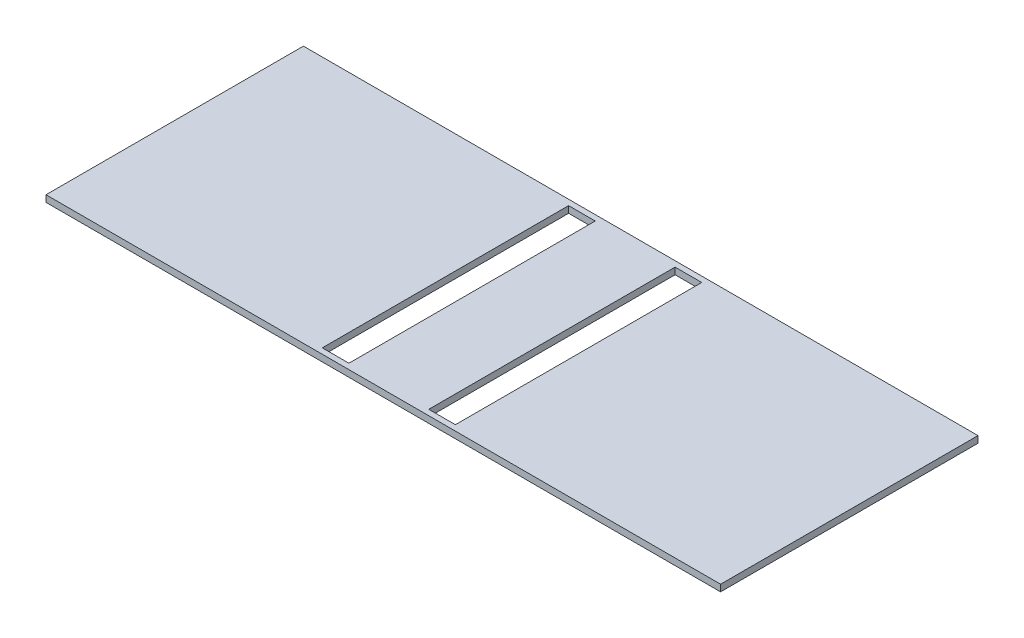
ISO-10303-21;
HEADER;
FILE_DESCRIPTION(('STEP AP214'),'2;1');
FILE_NAME('part.step','',(''),(''),'','','');
FILE_SCHEMA(('AUTOMOTIVE_DESIGN { 1 0 10303 214 1 1 1 1 }'));
ENDSEC;
DATA;
#1=APPLICATION_CONTEXT('core data for automotive mechanical design processes');
#2=APPLICATION_PROTOCOL_DEFINITION('international standard','automotive_design',2000,#1);
#3=PRODUCT_CONTEXT('',#1,'mechanical');
#4=PRODUCT('Part','Part','',(#3));
#5=PRODUCT_RELATED_PRODUCT_CATEGORY('part','',(#4));
#6=PRODUCT_DEFINITION_FORMATION('','',#4);
#7=PRODUCT_DEFINITION_CONTEXT('part definition',#1,'design');
#8=PRODUCT_DEFINITION('design','',#6,#7);
#9=PRODUCT_DEFINITION_SHAPE('','',#8);
#10=(LENGTH_UNIT() NAMED_UNIT(*) SI_UNIT(.MILLI.,.METRE.));
#11=(NAMED_UNIT(*) PLANE_ANGLE_UNIT() SI_UNIT($,.RADIAN.));
#12=(NAMED_UNIT(*) SI_UNIT($,.STERADIAN.) SOLID_ANGLE_UNIT());
#13=UNCERTAINTY_MEASURE_WITH_UNIT(LENGTH_MEASURE(1.E-05),#10,'distance_accuracy_value','');
#14=(GEOMETRIC_REPRESENTATION_CONTEXT(3) GLOBAL_UNCERTAINTY_ASSIGNED_CONTEXT((#13)) GLOBAL_UNIT_ASSIGNED_CONTEXT((#10,
#11,#12)) REPRESENTATION_CONTEXT('',''));
#15=CARTESIAN_POINT('',(0.,0.,0.));
#16=DIRECTION('',(0.,0.,1.));
#17=DIRECTION('',(1.,0.,0.));
#18=AXIS2_PLACEMENT_3D('',#15,#16,#17);
#19=CARTESIAN_POINT('',(-91.3544303797468,45.5,16.1518987341772));
#20=DIRECTION('',(1.,0.,0.));
#21=DIRECTION('',(0.,0.,-1.));
#22=AXIS2_PLACEMENT_3D('',#19,#20,#21);
#23=PLANE('',#22);
#24=DIRECTION('',(0.,0.,-1.));
#25=VECTOR('',#24,1.);
#26=CARTESIAN_POINT('',(-91.3544303797468,47.,16.1518987341772));
#27=LINE('',#26,#25);
#28=CARTESIAN_POINT('',(-91.3544303797468,47.,16.1518987341772));
#29=VERTEX_POINT('',#28);
#30=CARTESIAN_POINT('',(-91.3544303797468,47.,-41.8481012658228));
#31=VERTEX_POINT('',#30);
#32=EDGE_CURVE('E152',#29,#31,#27,.T.);
#33=ORIENTED_EDGE('',*,*,#32,.T.);
#34=DIRECTION('',(0.,1.,0.));
#35=VECTOR('',#34,1.);
#36=CARTESIAN_POINT('',(-91.3544303797468,45.5,-41.8481012658228));
#37=LINE('',#36,#35);
#38=CARTESIAN_POINT('',(-91.3544303797468,45.5,-41.8481012658228));
#39=VERTEX_POINT('',#38);
#40=EDGE_CURVE('E199',#39,#31,#37,.T.);
#41=ORIENTED_EDGE('',*,*,#40,.F.);
#42=DIRECTION('',(0.,0.,-1.));
#43=VECTOR('',#42,1.);
#44=CARTESIAN_POINT('',(-91.3544303797468,45.5,16.1518987341772));
#45=LINE('',#44,#43);
#46=CARTESIAN_POINT('',(-91.3544303797468,45.5,16.1518987341772));
#47=VERTEX_POINT('',#46);
#48=EDGE_CURVE('E173',#47,#39,#45,.T.);
#49=ORIENTED_EDGE('',*,*,#48,.F.);
#50=DIRECTION('',(0.,1.,0.));
#51=VECTOR('',#50,1.);
#52=CARTESIAN_POINT('',(-91.3544303797468,45.5,16.1518987341772));
#53=LINE('',#52,#51);
#54=EDGE_CURVE('E183',#47,#29,#53,.T.);
#55=ORIENTED_EDGE('',*,*,#54,.T.);
#56=EDGE_LOOP('',(#33,#41,#49,#55));
#57=FACE_BOUND('',#56,.T.);
#58=ADVANCED_FACE('F33',(#57),#23,.F.);
#59=CARTESIAN_POINT('',(-91.3544303797468,45.5,-41.8481012658228));
#60=DIRECTION('',(0.,0.,1.));
#61=DIRECTION('',(1.,0.,0.));
#62=AXIS2_PLACEMENT_3D('',#59,#60,#61);
#63=PLANE('',#62);
#64=DIRECTION('',(1.,0.,0.));
#65=VECTOR('',#64,1.);
#66=CARTESIAN_POINT('',(-91.3544303797468,47.,-41.8481012658228));
#67=LINE('',#66,#65);
#68=CARTESIAN_POINT('',(60.6371308016878,47.,-41.8481012658228));
#69=VERTEX_POINT('',#68);
#70=EDGE_CURVE('E186',#31,#69,#67,.T.);
#71=ORIENTED_EDGE('',*,*,#70,.T.);
#72=DIRECTION('',(0.,1.,0.));
#73=VECTOR('',#72,1.);
#74=CARTESIAN_POINT('',(60.6371308016878,45.5,-41.8481012658228));
#75=LINE('',#74,#73);
#76=CARTESIAN_POINT('',(60.6371308016878,45.5,-41.8481012658228));
#77=VERTEX_POINT('',#76);
#78=EDGE_CURVE('E196',#77,#69,#75,.T.);
#79=ORIENTED_EDGE('',*,*,#78,.F.);
#80=DIRECTION('',(1.,0.,0.));
#81=VECTOR('',#80,1.);
#82=CARTESIAN_POINT('',(-91.3544303797468,45.5,-41.8481012658228));
#83=LINE('',#82,#81);
#84=EDGE_CURVE('E176',#39,#77,#83,.T.);
#85=ORIENTED_EDGE('',*,*,#84,.F.);
#86=ORIENTED_EDGE('',*,*,#40,.T.);
#87=EDGE_LOOP('',(#71,#79,#85,#86));
#88=FACE_BOUND('',#87,.T.);
#89=ADVANCED_FACE('F238',(#88),#63,.F.);
#90=CARTESIAN_POINT('',(60.6371308016878,45.5,16.1518987341772));
#91=DIRECTION('',(-1.,0.,0.));
#92=DIRECTION('',(0.,0.,1.));
#93=AXIS2_PLACEMENT_3D('',#90,#91,#92);
#94=PLANE('',#93);
#95=DIRECTION('',(0.,0.,1.));
#96=VECTOR('',#95,1.);
#97=CARTESIAN_POINT('',(60.6371308016878,47.,16.1518987341772));
#98=LINE('',#97,#96);
#99=CARTESIAN_POINT('',(60.6371308016878,47.,16.1518987341772));
#100=VERTEX_POINT('',#99);
#101=EDGE_CURVE('E188',#69,#100,#98,.T.);
#102=ORIENTED_EDGE('',*,*,#101,.T.);
#103=DIRECTION('',(0.,1.,0.));
#104=VECTOR('',#103,1.);
#105=CARTESIAN_POINT('',(60.6371308016878,45.5,16.1518987341772));
#106=LINE('',#105,#104);
#107=CARTESIAN_POINT('',(60.6371308016878,45.5,16.1518987341772));
#108=VERTEX_POINT('',#107);
#109=EDGE_CURVE('E193',#108,#100,#106,.T.);
#110=ORIENTED_EDGE('',*,*,#109,.F.);
#111=DIRECTION('',(0.,0.,1.));
#112=VECTOR('',#111,1.);
#113=CARTESIAN_POINT('',(60.6371308016878,45.5,16.1518987341772));
#114=LINE('',#113,#112);
#115=EDGE_CURVE('E179',#77,#108,#114,.T.);
#116=ORIENTED_EDGE('',*,*,#115,.F.);
#117=ORIENTED_EDGE('',*,*,#78,.T.);
#118=EDGE_LOOP('',(#102,#110,#116,#117));
#119=FACE_BOUND('',#118,.T.);
#120=ADVANCED_FACE('F243',(#119),#94,.F.);
#121=CARTESIAN_POINT('',(-91.3544303797468,45.5,16.1518987341772));
#122=DIRECTION('',(0.,0.,-1.));
#123=DIRECTION('',(-1.,0.,0.));
#124=AXIS2_PLACEMENT_3D('',#121,#122,#123);
#125=PLANE('',#124);
#126=DIRECTION('',(-1.,0.,0.));
#127=VECTOR('',#126,1.);
#128=CARTESIAN_POINT('',(-91.3544303797468,47.,16.1518987341772));
#129=LINE('',#128,#127);
#130=EDGE_CURVE('E177',#100,#29,#129,.T.);
#131=ORIENTED_EDGE('',*,*,#130,.T.);
#132=ORIENTED_EDGE('',*,*,#54,.F.);
#133=DIRECTION('',(-1.,0.,0.));
#134=VECTOR('',#133,1.);
#135=CARTESIAN_POINT('',(-91.3544303797468,45.5,16.1518987341772));
#136=LINE('',#135,#134);
#137=EDGE_CURVE('E181',#108,#47,#136,.T.);
#138=ORIENTED_EDGE('',*,*,#137,.F.);
#139=ORIENTED_EDGE('',*,*,#109,.T.);
#140=EDGE_LOOP('',(#131,#132,#138,#139));
#141=FACE_BOUND('',#140,.T.);
#142=ADVANCED_FACE('F258',(#141),#125,.F.);
#143=CARTESIAN_POINT('',(0.,45.5,0.));
#144=DIRECTION('',(0.,-1.,0.));
#145=DIRECTION('',(0.,0.,-1.));
#146=AXIS2_PLACEMENT_3D('',#143,#144,#145);
#147=PLANE('',#146);
#148=DIRECTION('',(0.,0.,-1.));
#149=VECTOR('',#148,1.);
#150=CARTESIAN_POINT('',(-30.3544303797468,45.5,14.9018987341772));
#151=LINE('',#150,#149);
#152=CARTESIAN_POINT('',(-30.3544303797468,45.5,14.9018987341772));
#153=VERTEX_POINT('',#152);
#154=CARTESIAN_POINT('',(-30.3544303797468,45.5,-40.5936540286049));
#155=VERTEX_POINT('',#154);
#156=EDGE_CURVE('E47',#153,#155,#151,.T.);
#157=ORIENTED_EDGE('',*,*,#156,.F.);
#158=DIRECTION('',(-1.,0.,0.));
#159=VECTOR('',#158,1.);
#160=CARTESIAN_POINT('',(-30.3544303797468,45.5,14.9018987341772));
#161=LINE('',#160,#159);
#162=CARTESIAN_POINT('',(-24.3544303797468,45.5,14.9018987341772));
#163=VERTEX_POINT('',#162);
#164=EDGE_CURVE('E145',#163,#153,#161,.T.);
#165=ORIENTED_EDGE('',*,*,#164,.F.);
#166=DIRECTION('',(0.,0.,1.));
#167=VECTOR('',#166,1.);
#168=CARTESIAN_POINT('',(-24.3544303797468,45.5,14.9018987341772));
#169=LINE('',#168,#167);
#170=CARTESIAN_POINT('',(-24.3544303797468,45.5,-40.5936540286049));
#171=VERTEX_POINT('',#170);
#172=EDGE_CURVE('E128',#171,#163,#169,.T.);
#173=ORIENTED_EDGE('',*,*,#172,.F.);
#174=DIRECTION('',(1.,0.,0.));
#175=VECTOR('',#174,1.);
#176=CARTESIAN_POINT('',(-30.3544303797468,45.5,-40.5936540286049));
#177=LINE('',#176,#175);
#178=EDGE_CURVE('E138',#155,#171,#177,.T.);
#179=ORIENTED_EDGE('',*,*,#178,.F.);
#180=EDGE_LOOP('',(#157,#165,#173,#179));
#181=FACE_BOUND('',#180,.T.);
#182=DIRECTION('',(0.,0.,-1.));
#183=VECTOR('',#182,1.);
#184=CARTESIAN_POINT('',(-6.36286919831223,45.5,-40.5981012658228));
#185=LINE('',#184,#183);
#186=CARTESIAN_POINT('',(-6.36286919831223,45.5,14.9018987341772));
#187=VERTEX_POINT('',#186);
#188=CARTESIAN_POINT('',(-6.36286919831223,45.5,-40.5981012658228));
#189=VERTEX_POINT('',#188);
#190=EDGE_CURVE('E55',#187,#189,#185,.T.);
#191=ORIENTED_EDGE('',*,*,#190,.F.);
#192=DIRECTION('',(-1.,0.,0.));
#193=VECTOR('',#192,1.);
#194=CARTESIAN_POINT('',(-6.36286919831223,45.5,14.9018987341772));
#195=LINE('',#194,#193);
#196=CARTESIAN_POINT('',(-0.362869198312224,45.5,14.9018987341772));
#197=VERTEX_POINT('',#196);
#198=EDGE_CURVE('E162',#197,#187,#195,.T.);
#199=ORIENTED_EDGE('',*,*,#198,.F.);
#200=DIRECTION('',(0.,0.,1.));
#201=VECTOR('',#200,1.);
#202=CARTESIAN_POINT('',(-0.362869198312224,45.5,-40.5981012658228));
#203=LINE('',#202,#201);
#204=CARTESIAN_POINT('',(-0.362869198312224,45.5,-40.5981012658228));
#205=VERTEX_POINT('',#204);
#206=EDGE_CURVE('E159',#205,#197,#203,.T.);
#207=ORIENTED_EDGE('',*,*,#206,.F.);
#208=DIRECTION('',(1.,0.,0.));
#209=VECTOR('',#208,1.);
#210=CARTESIAN_POINT('',(-6.36286919831223,45.5,-40.5981012658228));
#211=LINE('',#210,#209);
#212=EDGE_CURVE('E156',#189,#205,#211,.T.);
#213=ORIENTED_EDGE('',*,*,#212,.F.);
#214=EDGE_LOOP('',(#191,#199,#207,#213));
#215=FACE_BOUND('',#214,.T.);
#216=ORIENTED_EDGE('',*,*,#48,.T.);
#217=ORIENTED_EDGE('',*,*,#84,.T.);
#218=ORIENTED_EDGE('',*,*,#115,.T.);
#219=ORIENTED_EDGE('',*,*,#137,.T.);
#220=EDGE_LOOP('',(#216,#217,#218,#219));
#221=FACE_BOUND('',#220,.T.);
#222=ADVANCED_FACE('F142',(#181,#215,#221),#147,.T.);
#223=CARTESIAN_POINT('',(0.,47.,0.));
#224=DIRECTION('',(0.,-1.,0.));
#225=DIRECTION('',(0.,0.,-1.));
#226=AXIS2_PLACEMENT_3D('',#223,#224,#225);
#227=PLANE('',#226);
#228=DIRECTION('',(-1.,0.,0.));
#229=VECTOR('',#228,1.);
#230=CARTESIAN_POINT('',(0.,47.,14.9018987341772));
#231=LINE('',#230,#229);
#232=CARTESIAN_POINT('',(-24.3544303797468,47.,14.9018987341772));
#233=VERTEX_POINT('',#232);
#234=CARTESIAN_POINT('',(-30.3544303797468,47.,14.9018987341772));
#235=VERTEX_POINT('',#234);
#236=EDGE_CURVE('E40',#233,#235,#231,.T.);
#237=ORIENTED_EDGE('',*,*,#236,.T.);
#238=DIRECTION('',(0.,0.,-1.));
#239=VECTOR('',#238,1.);
#240=CARTESIAN_POINT('',(-30.3544303797468,47.,0.));
#241=LINE('',#240,#239);
#242=CARTESIAN_POINT('',(-30.3544303797468,47.,-40.5936540286049));
#243=VERTEX_POINT('',#242);
#244=EDGE_CURVE('E11',#235,#243,#241,.T.);
#245=ORIENTED_EDGE('',*,*,#244,.T.);
#246=DIRECTION('',(1.,0.,0.));
#247=VECTOR('',#246,1.);
#248=CARTESIAN_POINT('',(0.,47.,-40.5936540286049));
#249=LINE('',#248,#247);
#250=CARTESIAN_POINT('',(-24.3544303797468,47.,-40.5936540286049));
#251=VERTEX_POINT('',#250);
#252=EDGE_CURVE('E214',#243,#251,#249,.T.);
#253=ORIENTED_EDGE('',*,*,#252,.T.);
#254=DIRECTION('',(0.,0.,1.));
#255=VECTOR('',#254,1.);
#256=CARTESIAN_POINT('',(-24.3544303797468,47.,0.));
#257=LINE('',#256,#255);
#258=EDGE_CURVE('E131',#251,#233,#257,.T.);
#259=ORIENTED_EDGE('',*,*,#258,.T.);
#260=EDGE_LOOP('',(#237,#245,#253,#259));
#261=FACE_BOUND('',#260,.T.);
#262=DIRECTION('',(-1.,0.,0.));
#263=VECTOR('',#262,1.);
#264=CARTESIAN_POINT('',(0.,47.,14.9018987341772));
#265=LINE('',#264,#263);
#266=CARTESIAN_POINT('',(-0.362869198312224,47.,14.9018987341772));
#267=VERTEX_POINT('',#266);
#268=CARTESIAN_POINT('',(-6.36286919831223,47.,14.9018987341772));
#269=VERTEX_POINT('',#268);
#270=EDGE_CURVE('E208',#267,#269,#265,.T.);
#271=ORIENTED_EDGE('',*,*,#270,.T.);
#272=DIRECTION('',(0.,0.,-1.));
#273=VECTOR('',#272,1.);
#274=CARTESIAN_POINT('',(-6.36286919831223,47.,0.));
#275=LINE('',#274,#273);
#276=CARTESIAN_POINT('',(-6.36286919831223,47.,-40.5981012658228));
#277=VERTEX_POINT('',#276);
#278=EDGE_CURVE('E211',#269,#277,#275,.T.);
#279=ORIENTED_EDGE('',*,*,#278,.T.);
#280=DIRECTION('',(1.,0.,0.));
#281=VECTOR('',#280,1.);
#282=CARTESIAN_POINT('',(0.,47.,-40.5981012658228));
#283=LINE('',#282,#281);
#284=CARTESIAN_POINT('',(-0.362869198312224,47.,-40.5981012658228));
#285=VERTEX_POINT('',#284);
#286=EDGE_CURVE('E202',#277,#285,#283,.T.);
#287=ORIENTED_EDGE('',*,*,#286,.T.);
#288=DIRECTION('',(0.,0.,1.));
#289=VECTOR('',#288,1.);
#290=CARTESIAN_POINT('',(-0.362869198312224,47.,0.));
#291=LINE('',#290,#289);
#292=EDGE_CURVE('E205',#285,#267,#291,.T.);
#293=ORIENTED_EDGE('',*,*,#292,.T.);
#294=EDGE_LOOP('',(#271,#279,#287,#293));
#295=FACE_BOUND('',#294,.T.);
#296=ORIENTED_EDGE('',*,*,#32,.F.);
#297=ORIENTED_EDGE('',*,*,#130,.F.);
#298=ORIENTED_EDGE('',*,*,#101,.F.);
#299=ORIENTED_EDGE('',*,*,#70,.F.);
#300=EDGE_LOOP('',(#296,#297,#298,#299));
#301=FACE_BOUND('',#300,.T.);
#302=ADVANCED_FACE('F218',(#261,#295,#301),#227,.F.);
#303=CARTESIAN_POINT('',(-6.36286919831223,57.,-40.5981012658228));
#304=DIRECTION('',(-1.,0.,0.));
#305=DIRECTION('',(0.,0.,1.));
#306=AXIS2_PLACEMENT_3D('',#303,#304,#305);
#307=PLANE('',#306);
#308=DIRECTION('',(0.,-1.,0.));
#309=VECTOR('',#308,1.);
#310=CARTESIAN_POINT('',(-6.36286919831223,57.,14.9018987341772));
#311=LINE('',#310,#309);
#312=EDGE_CURVE('E166',#269,#187,#311,.T.);
#313=ORIENTED_EDGE('',*,*,#312,.T.);
#314=ORIENTED_EDGE('',*,*,#190,.T.);
#315=DIRECTION('',(0.,-1.,0.));
#316=VECTOR('',#315,1.);
#317=CARTESIAN_POINT('',(-6.36286919831223,57.,-40.5981012658228));
#318=LINE('',#317,#316);
#319=EDGE_CURVE('E165',#277,#189,#318,.T.);
#320=ORIENTED_EDGE('',*,*,#319,.F.);
#321=ORIENTED_EDGE('',*,*,#278,.F.);
#322=EDGE_LOOP('',(#313,#314,#320,#321));
#323=FACE_BOUND('',#322,.T.);
#324=ADVANCED_FACE('F269',(#323),#307,.F.);
#325=CARTESIAN_POINT('',(-6.36286919831223,57.,14.9018987341772));
#326=DIRECTION('',(0.,0.,1.));
#327=DIRECTION('',(1.,0.,0.));
#328=AXIS2_PLACEMENT_3D('',#325,#326,#327);
#329=PLANE('',#328);
#330=DIRECTION('',(0.,-1.,0.));
#331=VECTOR('',#330,1.);
#332=CARTESIAN_POINT('',(-0.362869198312224,57.,14.9018987341772));
#333=LINE('',#332,#331);
#334=EDGE_CURVE('E168',#267,#197,#333,.T.);
#335=ORIENTED_EDGE('',*,*,#334,.T.);
#336=ORIENTED_EDGE('',*,*,#198,.T.);
#337=ORIENTED_EDGE('',*,*,#312,.F.);
#338=ORIENTED_EDGE('',*,*,#270,.F.);
#339=EDGE_LOOP('',(#335,#336,#337,#338));
#340=FACE_BOUND('',#339,.T.);
#341=ADVANCED_FACE('F273',(#340),#329,.F.);
#342=CARTESIAN_POINT('',(-0.362869198312224,57.,-40.5981012658228));
#343=DIRECTION('',(1.,0.,0.));
#344=DIRECTION('',(0.,0.,-1.));
#345=AXIS2_PLACEMENT_3D('',#342,#343,#344);
#346=PLANE('',#345);
#347=DIRECTION('',(0.,-1.,0.));
#348=VECTOR('',#347,1.);
#349=CARTESIAN_POINT('',(-0.362869198312224,57.,-40.5981012658228));
#350=LINE('',#349,#348);
#351=EDGE_CURVE('E170',#285,#205,#350,.T.);
#352=ORIENTED_EDGE('',*,*,#351,.T.);
#353=ORIENTED_EDGE('',*,*,#206,.T.);
#354=ORIENTED_EDGE('',*,*,#334,.F.);
#355=ORIENTED_EDGE('',*,*,#292,.F.);
#356=EDGE_LOOP('',(#352,#353,#354,#355));
#357=FACE_BOUND('',#356,.T.);
#358=ADVANCED_FACE('F232',(#357),#346,.F.);
#359=CARTESIAN_POINT('',(-6.36286919831223,57.,-40.5981012658228));
#360=DIRECTION('',(0.,0.,-1.));
#361=DIRECTION('',(-1.,0.,0.));
#362=AXIS2_PLACEMENT_3D('',#359,#360,#361);
#363=PLANE('',#362);
#364=ORIENTED_EDGE('',*,*,#319,.T.);
#365=ORIENTED_EDGE('',*,*,#212,.T.);
#366=ORIENTED_EDGE('',*,*,#351,.F.);
#367=ORIENTED_EDGE('',*,*,#286,.F.);
#368=EDGE_LOOP('',(#364,#365,#366,#367));
#369=FACE_BOUND('',#368,.T.);
#370=ADVANCED_FACE('F225',(#369),#363,.F.);
#371=CARTESIAN_POINT('',(-30.3544303797468,57.,14.9018987341772));
#372=DIRECTION('',(-1.,0.,0.));
#373=DIRECTION('',(0.,0.,1.));
#374=AXIS2_PLACEMENT_3D('',#371,#372,#373);
#375=PLANE('',#374);
#376=DIRECTION('',(0.,-1.,0.));
#377=VECTOR('',#376,1.);
#378=CARTESIAN_POINT('',(-30.3544303797468,57.,14.9018987341772));
#379=LINE('',#378,#377);
#380=EDGE_CURVE('E150',#235,#153,#379,.T.);
#381=ORIENTED_EDGE('',*,*,#380,.T.);
#382=ORIENTED_EDGE('',*,*,#156,.T.);
#383=DIRECTION('',(0.,-1.,0.));
#384=VECTOR('',#383,1.);
#385=CARTESIAN_POINT('',(-30.3544303797468,57.,-40.5936540286049));
#386=LINE('',#385,#384);
#387=EDGE_CURVE('E135',#243,#155,#386,.T.);
#388=ORIENTED_EDGE('',*,*,#387,.F.);
#389=ORIENTED_EDGE('',*,*,#244,.F.);
#390=EDGE_LOOP('',(#381,#382,#388,#389));
#391=FACE_BOUND('',#390,.T.);
#392=ADVANCED_FACE('F223',(#391),#375,.F.);
#393=CARTESIAN_POINT('',(-30.3544303797468,57.,14.9018987341772));
#394=DIRECTION('',(0.,0.,1.));
#395=DIRECTION('',(1.,0.,0.));
#396=AXIS2_PLACEMENT_3D('',#393,#394,#395);
#397=PLANE('',#396);
#398=DIRECTION('',(0.,-1.,0.));
#399=VECTOR('',#398,1.);
#400=CARTESIAN_POINT('',(-24.3544303797468,57.,14.9018987341772));
#401=LINE('',#400,#399);
#402=EDGE_CURVE('E134',#233,#163,#401,.T.);
#403=ORIENTED_EDGE('',*,*,#402,.T.);
#404=ORIENTED_EDGE('',*,*,#164,.T.);
#405=ORIENTED_EDGE('',*,*,#380,.F.);
#406=ORIENTED_EDGE('',*,*,#236,.F.);
#407=EDGE_LOOP('',(#403,#404,#405,#406));
#408=FACE_BOUND('',#407,.T.);
#409=ADVANCED_FACE('F222',(#408),#397,.F.);
#410=CARTESIAN_POINT('',(-24.3544303797468,57.,14.9018987341772));
#411=DIRECTION('',(1.,0.,0.));
#412=DIRECTION('',(0.,0.,-1.));
#413=AXIS2_PLACEMENT_3D('',#410,#411,#412);
#414=PLANE('',#413);
#415=DIRECTION('',(0.,-1.,0.));
#416=VECTOR('',#415,1.);
#417=CARTESIAN_POINT('',(-24.3544303797468,57.,-40.5936540286049));
#418=LINE('',#417,#416);
#419=EDGE_CURVE('E123',#251,#171,#418,.T.);
#420=ORIENTED_EDGE('',*,*,#419,.T.);
#421=ORIENTED_EDGE('',*,*,#172,.T.);
#422=ORIENTED_EDGE('',*,*,#402,.F.);
#423=ORIENTED_EDGE('',*,*,#258,.F.);
#424=EDGE_LOOP('',(#420,#421,#422,#423));
#425=FACE_BOUND('',#424,.T.);
#426=ADVANCED_FACE('F125',(#425),#414,.F.);
#427=CARTESIAN_POINT('',(-30.3544303797468,57.,-40.5936540286049));
#428=DIRECTION('',(0.,0.,-1.));
#429=DIRECTION('',(-1.,0.,0.));
#430=AXIS2_PLACEMENT_3D('',#427,#428,#429);
#431=PLANE('',#430);
#432=ORIENTED_EDGE('',*,*,#387,.T.);
#433=ORIENTED_EDGE('',*,*,#178,.T.);
#434=ORIENTED_EDGE('',*,*,#419,.F.);
#435=ORIENTED_EDGE('',*,*,#252,.F.);
#436=EDGE_LOOP('',(#432,#433,#434,#435));
#437=FACE_BOUND('',#436,.T.);
#438=ADVANCED_FACE('F139',(#437),#431,.F.);
#439=CLOSED_SHELL('',(#58,#89,#120,#142,#222,#302,#324,#341,#358,#370,#392,#409,#426,#438));
#440=MANIFOLD_SOLID_BREP('B2',#439);
#441=ADVANCED_BREP_SHAPE_REPRESENTATION('',(#18,#440),#14);
#442=SHAPE_DEFINITION_REPRESENTATION(#9,#441);
ENDSEC;
END-ISO-10303-21;
